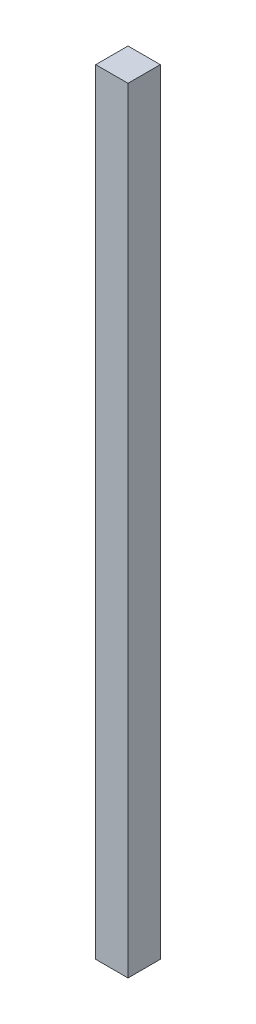
ISO-10303-21;
HEADER;
FILE_DESCRIPTION(('STEP AP214'),'2;1');
FILE_NAME('part.step','',(''),(''),'','','');
FILE_SCHEMA(('AUTOMOTIVE_DESIGN { 1 0 10303 214 1 1 1 1 }'));
ENDSEC;
DATA;
#1=APPLICATION_CONTEXT('core data for automotive mechanical design processes');
#2=APPLICATION_PROTOCOL_DEFINITION('international standard','automotive_design',2000,#1);
#3=PRODUCT_CONTEXT('',#1,'mechanical');
#4=PRODUCT('Part','Part','',(#3));
#5=PRODUCT_RELATED_PRODUCT_CATEGORY('part','',(#4));
#6=PRODUCT_DEFINITION_FORMATION('','',#4);
#7=PRODUCT_DEFINITION_CONTEXT('part definition',#1,'design');
#8=PRODUCT_DEFINITION('design','',#6,#7);
#9=PRODUCT_DEFINITION_SHAPE('','',#8);
#10=(LENGTH_UNIT() NAMED_UNIT(*) SI_UNIT(.MILLI.,.METRE.));
#11=(NAMED_UNIT(*) PLANE_ANGLE_UNIT() SI_UNIT($,.RADIAN.));
#12=(NAMED_UNIT(*) SI_UNIT($,.STERADIAN.) SOLID_ANGLE_UNIT());
#13=UNCERTAINTY_MEASURE_WITH_UNIT(LENGTH_MEASURE(1.E-05),#10,'distance_accuracy_value','');
#14=(GEOMETRIC_REPRESENTATION_CONTEXT(3) GLOBAL_UNCERTAINTY_ASSIGNED_CONTEXT((#13)) GLOBAL_UNIT_ASSIGNED_CONTEXT((#10,
#11,#12)) REPRESENTATION_CONTEXT('',''));
#15=CARTESIAN_POINT('',(0.,0.,0.));
#16=DIRECTION('',(0.,0.,1.));
#17=DIRECTION('',(1.,0.,0.));
#18=AXIS2_PLACEMENT_3D('',#15,#16,#17);
#19=CARTESIAN_POINT('',(-12.7,304.8,-12.7));
#20=DIRECTION('',(1.,0.,0.));
#21=DIRECTION('',(0.,0.,-1.));
#22=AXIS2_PLACEMENT_3D('',#19,#20,#21);
#23=PLANE('',#22);
#24=DIRECTION('',(0.,0.,1.));
#25=VECTOR('',#24,1.);
#26=CARTESIAN_POINT('',(-12.7,-304.8,-12.7));
#27=LINE('',#26,#25);
#28=CARTESIAN_POINT('',(-12.7,-304.8,-12.7));
#29=VERTEX_POINT('',#28);
#30=CARTESIAN_POINT('',(-12.7,-304.8,12.7));
#31=VERTEX_POINT('',#30);
#32=EDGE_CURVE('E109',#29,#31,#27,.T.);
#33=ORIENTED_EDGE('',*,*,#32,.T.);
#34=DIRECTION('',(0.,-1.,0.));
#35=VECTOR('',#34,1.);
#36=CARTESIAN_POINT('',(-12.7,304.8,12.7));
#37=LINE('',#36,#35);
#38=CARTESIAN_POINT('',(-12.7,304.8,12.7));
#39=VERTEX_POINT('',#38);
#40=EDGE_CURVE('E11',#39,#31,#37,.T.);
#41=ORIENTED_EDGE('',*,*,#40,.F.);
#42=DIRECTION('',(0.,0.,1.));
#43=VECTOR('',#42,1.);
#44=CARTESIAN_POINT('',(-12.7,304.8,-12.7));
#45=LINE('',#44,#43);
#46=CARTESIAN_POINT('',(-12.7,304.8,-12.7));
#47=VERTEX_POINT('',#46);
#48=EDGE_CURVE('E93',#47,#39,#45,.T.);
#49=ORIENTED_EDGE('',*,*,#48,.F.);
#50=DIRECTION('',(0.,-1.,0.));
#51=VECTOR('',#50,1.);
#52=CARTESIAN_POINT('',(-12.7,304.8,-12.7));
#53=LINE('',#52,#51);
#54=EDGE_CURVE('E105',#47,#29,#53,.T.);
#55=ORIENTED_EDGE('',*,*,#54,.T.);
#56=EDGE_LOOP('',(#33,#41,#49,#55));
#57=FACE_BOUND('',#56,.T.);
#58=ADVANCED_FACE('F41',(#57),#23,.F.);
#59=CARTESIAN_POINT('',(-12.7,304.8,12.7));
#60=DIRECTION('',(0.,0.,-1.));
#61=DIRECTION('',(-1.,0.,0.));
#62=AXIS2_PLACEMENT_3D('',#59,#60,#61);
#63=PLANE('',#62);
#64=DIRECTION('',(1.,0.,0.));
#65=VECTOR('',#64,1.);
#66=CARTESIAN_POINT('',(-12.7,-304.8,12.7));
#67=LINE('',#66,#65);
#68=CARTESIAN_POINT('',(12.7,-304.8,12.7));
#69=VERTEX_POINT('',#68);
#70=EDGE_CURVE('E98',#31,#69,#67,.T.);
#71=ORIENTED_EDGE('',*,*,#70,.T.);
#72=DIRECTION('',(0.,-1.,0.));
#73=VECTOR('',#72,1.);
#74=CARTESIAN_POINT('',(12.7,304.8,12.7));
#75=LINE('',#74,#73);
#76=CARTESIAN_POINT('',(12.7,304.8,12.7));
#77=VERTEX_POINT('',#76);
#78=EDGE_CURVE('E50',#77,#69,#75,.T.);
#79=ORIENTED_EDGE('',*,*,#78,.F.);
#80=DIRECTION('',(1.,0.,0.));
#81=VECTOR('',#80,1.);
#82=CARTESIAN_POINT('',(-12.7,304.8,12.7));
#83=LINE('',#82,#81);
#84=EDGE_CURVE('E88',#39,#77,#83,.T.);
#85=ORIENTED_EDGE('',*,*,#84,.F.);
#86=ORIENTED_EDGE('',*,*,#40,.T.);
#87=EDGE_LOOP('',(#71,#79,#85,#86));
#88=FACE_BOUND('',#87,.T.);
#89=ADVANCED_FACE('F97',(#88),#63,.F.);
#90=CARTESIAN_POINT('',(12.7,304.8,-12.7));
#91=DIRECTION('',(-1.,0.,0.));
#92=DIRECTION('',(0.,0.,1.));
#93=AXIS2_PLACEMENT_3D('',#90,#91,#92);
#94=PLANE('',#93);
#95=DIRECTION('',(0.,0.,-1.));
#96=VECTOR('',#95,1.);
#97=CARTESIAN_POINT('',(12.7,-304.8,-12.7));
#98=LINE('',#97,#96);
#99=CARTESIAN_POINT('',(12.7,-304.8,-12.7));
#100=VERTEX_POINT('',#99);
#101=EDGE_CURVE('E75',#69,#100,#98,.T.);
#102=ORIENTED_EDGE('',*,*,#101,.T.);
#103=DIRECTION('',(0.,-1.,0.));
#104=VECTOR('',#103,1.);
#105=CARTESIAN_POINT('',(12.7,304.8,-12.7));
#106=LINE('',#105,#104);
#107=CARTESIAN_POINT('',(12.7,304.8,-12.7));
#108=VERTEX_POINT('',#107);
#109=EDGE_CURVE('E100',#108,#100,#106,.T.);
#110=ORIENTED_EDGE('',*,*,#109,.F.);
#111=DIRECTION('',(0.,0.,-1.));
#112=VECTOR('',#111,1.);
#113=CARTESIAN_POINT('',(12.7,304.8,-12.7));
#114=LINE('',#113,#112);
#115=EDGE_CURVE('E91',#77,#108,#114,.T.);
#116=ORIENTED_EDGE('',*,*,#115,.F.);
#117=ORIENTED_EDGE('',*,*,#78,.T.);
#118=EDGE_LOOP('',(#102,#110,#116,#117));
#119=FACE_BOUND('',#118,.T.);
#120=ADVANCED_FACE('F101',(#119),#94,.F.);
#121=CARTESIAN_POINT('',(-12.7,304.8,-12.7));
#122=DIRECTION('',(0.,0.,1.));
#123=DIRECTION('',(1.,0.,0.));
#124=AXIS2_PLACEMENT_3D('',#121,#122,#123);
#125=PLANE('',#124);
#126=DIRECTION('',(-1.,0.,0.));
#127=VECTOR('',#126,1.);
#128=CARTESIAN_POINT('',(-12.7,-304.8,-12.7));
#129=LINE('',#128,#127);
#130=EDGE_CURVE('E81',#100,#29,#129,.T.);
#131=ORIENTED_EDGE('',*,*,#130,.T.);
#132=ORIENTED_EDGE('',*,*,#54,.F.);
#133=DIRECTION('',(-1.,0.,0.));
#134=VECTOR('',#133,1.);
#135=CARTESIAN_POINT('',(-12.7,304.8,-12.7));
#136=LINE('',#135,#134);
#137=EDGE_CURVE('E58',#108,#47,#136,.T.);
#138=ORIENTED_EDGE('',*,*,#137,.F.);
#139=ORIENTED_EDGE('',*,*,#109,.T.);
#140=EDGE_LOOP('',(#131,#132,#138,#139));
#141=FACE_BOUND('',#140,.T.);
#142=ADVANCED_FACE('F122',(#141),#125,.F.);
#143=CARTESIAN_POINT('',(0.,304.8,0.));
#144=DIRECTION('',(0.,1.,0.));
#145=DIRECTION('',(0.,0.,1.));
#146=AXIS2_PLACEMENT_3D('',#143,#144,#145);
#147=PLANE('',#146);
#148=ORIENTED_EDGE('',*,*,#48,.T.);
#149=ORIENTED_EDGE('',*,*,#84,.T.);
#150=ORIENTED_EDGE('',*,*,#115,.T.);
#151=ORIENTED_EDGE('',*,*,#137,.T.);
#152=EDGE_LOOP('',(#148,#149,#150,#151));
#153=FACE_BOUND('',#152,.T.);
#154=ADVANCED_FACE('F89',(#153),#147,.T.);
#155=CARTESIAN_POINT('',(0.,-304.8,0.));
#156=DIRECTION('',(0.,1.,0.));
#157=DIRECTION('',(0.,0.,1.));
#158=AXIS2_PLACEMENT_3D('',#155,#156,#157);
#159=PLANE('',#158);
#160=ORIENTED_EDGE('',*,*,#32,.F.);
#161=ORIENTED_EDGE('',*,*,#130,.F.);
#162=ORIENTED_EDGE('',*,*,#101,.F.);
#163=ORIENTED_EDGE('',*,*,#70,.F.);
#164=EDGE_LOOP('',(#160,#161,#162,#163));
#165=FACE_BOUND('',#164,.T.);
#166=ADVANCED_FACE('F125',(#165),#159,.F.);
#167=CLOSED_SHELL('',(#58,#89,#120,#142,#154,#166));
#168=MANIFOLD_SOLID_BREP('B2',#167);
#169=ADVANCED_BREP_SHAPE_REPRESENTATION('',(#18,#168),#14);
#170=SHAPE_DEFINITION_REPRESENTATION(#9,#169);
ENDSEC;
END-ISO-10303-21;
